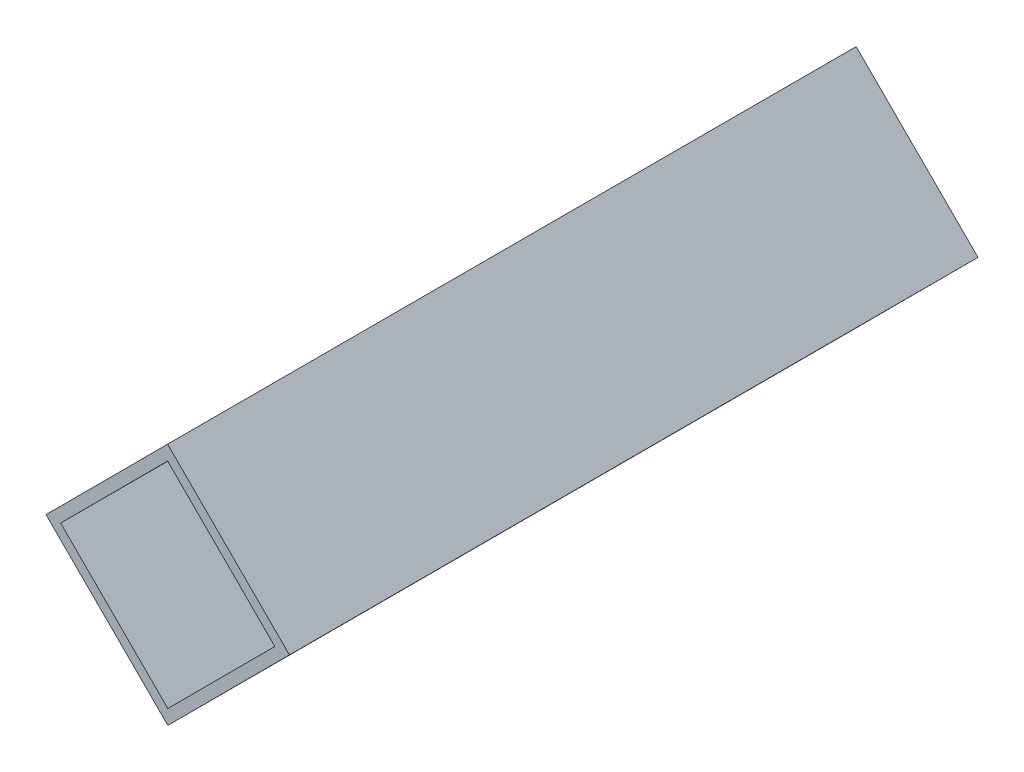
ISO-10303-21;
HEADER;
FILE_DESCRIPTION(('STEP AP214'),'2;1');
FILE_NAME('part.step','',(''),(''),'','','');
FILE_SCHEMA(('AUTOMOTIVE_DESIGN { 1 0 10303 214 1 1 1 1 }'));
ENDSEC;
DATA;
#1=APPLICATION_CONTEXT('core data for automotive mechanical design processes');
#2=APPLICATION_PROTOCOL_DEFINITION('international standard','automotive_design',2000,#1);
#3=PRODUCT_CONTEXT('',#1,'mechanical');
#4=PRODUCT('Part','Part','',(#3));
#5=PRODUCT_RELATED_PRODUCT_CATEGORY('part','',(#4));
#6=PRODUCT_DEFINITION_FORMATION('','',#4);
#7=PRODUCT_DEFINITION_CONTEXT('part definition',#1,'design');
#8=PRODUCT_DEFINITION('design','',#6,#7);
#9=PRODUCT_DEFINITION_SHAPE('','',#8);
#10=(LENGTH_UNIT() NAMED_UNIT(*) SI_UNIT(.MILLI.,.METRE.));
#11=(NAMED_UNIT(*) PLANE_ANGLE_UNIT() SI_UNIT($,.RADIAN.));
#12=(NAMED_UNIT(*) SI_UNIT($,.STERADIAN.) SOLID_ANGLE_UNIT());
#13=UNCERTAINTY_MEASURE_WITH_UNIT(LENGTH_MEASURE(1.E-05),#10,'distance_accuracy_value','');
#14=(GEOMETRIC_REPRESENTATION_CONTEXT(3) GLOBAL_UNCERTAINTY_ASSIGNED_CONTEXT((#13)) GLOBAL_UNIT_ASSIGNED_CONTEXT((#10,
#11,#12)) REPRESENTATION_CONTEXT('',''));
#15=CARTESIAN_POINT('',(0.,0.,0.));
#16=DIRECTION('',(0.,0.,1.));
#17=DIRECTION('',(1.,0.,0.));
#18=AXIS2_PLACEMENT_3D('',#15,#16,#17);
#19=CARTESIAN_POINT('',(0.,0.,100.));
#20=DIRECTION('',(0.,0.,1.));
#21=DIRECTION('',(1.,0.,0.));
#22=AXIS2_PLACEMENT_3D('',#19,#20,#21);
#23=PLANE('',#22);
#24=DIRECTION('',(-0.70646122875546,-0.707751744798503,0.));
#25=VECTOR('',#24,1.);
#26=CARTESIAN_POINT('',(0.,0.,100.));
#27=LINE('',#26,#25);
#28=CARTESIAN_POINT('',(0.,0.,100.));
#29=VERTEX_POINT('',#28);
#30=CARTESIAN_POINT('',(-17.6615307188865,-17.6937936199626,100.));
#31=VERTEX_POINT('',#30);
#32=EDGE_CURVE('E153',#29,#31,#27,.T.);
#33=ORIENTED_EDGE('',*,*,#32,.T.);
#34=DIRECTION('',(0.707751744798503,-0.70646122875546,0.));
#35=VECTOR('',#34,1.);
#36=CARTESIAN_POINT('',(-17.6615307188865,-17.6937936199626,100.));
#37=LINE('',#36,#35);
#38=CARTESIAN_POINT('',(0.0322629010760627,-35.3553243388491,100.));
#39=VERTEX_POINT('',#38);
#40=EDGE_CURVE('E157',#31,#39,#37,.T.);
#41=ORIENTED_EDGE('',*,*,#40,.T.);
#42=DIRECTION('',(0.70646122875546,0.707751744798503,0.));
#43=VECTOR('',#42,1.);
#44=CARTESIAN_POINT('',(17.6937936199626,-17.6615307188865,100.));
#45=LINE('',#44,#43);
#46=CARTESIAN_POINT('',(17.6937936199626,-17.6615307188865,100.));
#47=VERTEX_POINT('',#46);
#48=EDGE_CURVE('E161',#39,#47,#45,.T.);
#49=ORIENTED_EDGE('',*,*,#48,.T.);
#50=DIRECTION('',(-0.707751744798503,0.70646122875546,0.));
#51=VECTOR('',#50,1.);
#52=CARTESIAN_POINT('',(0.,0.,100.));
#53=LINE('',#52,#51);
#54=EDGE_CURVE('E164',#47,#29,#53,.T.);
#55=ORIENTED_EDGE('',*,*,#54,.T.);
#56=EDGE_LOOP('',(#33,#41,#49,#55));
#57=FACE_BOUND('',#56,.T.);
#58=DIRECTION('',(-0.706461228755461,-0.707751744798503,0.));
#59=VECTOR('',#58,1.);
#60=CARTESIAN_POINT('',(0.00193577406456353,-2.12131946033095,100.));
#61=LINE('',#60,#59);
#62=CARTESIAN_POINT('',(0.00193577406456353,-2.12131946033095,100.));
#63=VERTEX_POINT('',#62);
#64=CARTESIAN_POINT('',(-15.5402112585556,-17.691857845898,100.));
#65=VERTEX_POINT('',#64);
#66=EDGE_CURVE('E114',#63,#65,#61,.T.);
#67=ORIENTED_EDGE('',*,*,#66,.F.);
#68=DIRECTION('',(-0.707751744798503,0.70646122875546,0.));
#69=VECTOR('',#68,1.);
#70=CARTESIAN_POINT('',(0.00193577406456353,-2.12131946033095,100.));
#71=LINE('',#70,#69);
#72=CARTESIAN_POINT('',(15.5724741596316,-17.6634664929511,100.));
#73=VERTEX_POINT('',#72);
#74=EDGE_CURVE('E105',#73,#63,#71,.T.);
#75=ORIENTED_EDGE('',*,*,#74,.F.);
#76=DIRECTION('',(0.70646122875546,0.707751744798503,0.));
#77=VECTOR('',#76,1.);
#78=CARTESIAN_POINT('',(15.5724741596316,-17.6634664929511,100.));
#79=LINE('',#78,#77);
#80=CARTESIAN_POINT('',(0.0303271270114952,-33.2340048785181,100.));
#81=VERTEX_POINT('',#80);
#82=EDGE_CURVE('E131',#81,#73,#79,.T.);
#83=ORIENTED_EDGE('',*,*,#82,.F.);
#84=DIRECTION('',(0.707751744798503,-0.70646122875546,0.));
#85=VECTOR('',#84,1.);
#86=CARTESIAN_POINT('',(-15.5402112585556,-17.691857845898,100.));
#87=LINE('',#86,#85);
#88=EDGE_CURVE('E127',#65,#81,#87,.T.);
#89=ORIENTED_EDGE('',*,*,#88,.F.);
#90=EDGE_LOOP('',(#67,#75,#83,#89));
#91=FACE_BOUND('',#90,.T.);
#92=ADVANCED_FACE('F39',(#57,#91),#23,.T.);
#93=CARTESIAN_POINT('',(0.,0.,0.));
#94=DIRECTION('',(0.,0.,1.));
#95=DIRECTION('',(1.,0.,0.));
#96=AXIS2_PLACEMENT_3D('',#93,#94,#95);
#97=PLANE('',#96);
#98=DIRECTION('',(-0.70646122875546,-0.707751744798503,0.));
#99=VECTOR('',#98,1.);
#100=CARTESIAN_POINT('',(0.,0.,0.));
#101=LINE('',#100,#99);
#102=CARTESIAN_POINT('',(0.,0.,0.));
#103=VERTEX_POINT('',#102);
#104=CARTESIAN_POINT('',(-17.6615307188865,-17.6937936199626,0.));
#105=VERTEX_POINT('',#104);
#106=EDGE_CURVE('E123',#103,#105,#101,.T.);
#107=ORIENTED_EDGE('',*,*,#106,.F.);
#108=DIRECTION('',(-0.707751744798503,0.70646122875546,0.));
#109=VECTOR('',#108,1.);
#110=CARTESIAN_POINT('',(0.,0.,0.));
#111=LINE('',#110,#109);
#112=CARTESIAN_POINT('',(17.6937936199626,-17.6615307188865,0.));
#113=VERTEX_POINT('',#112);
#114=EDGE_CURVE('E158',#113,#103,#111,.T.);
#115=ORIENTED_EDGE('',*,*,#114,.F.);
#116=DIRECTION('',(0.70646122875546,0.707751744798503,0.));
#117=VECTOR('',#116,1.);
#118=CARTESIAN_POINT('',(17.6937936199626,-17.6615307188865,0.));
#119=LINE('',#118,#117);
#120=CARTESIAN_POINT('',(0.0322629010760627,-35.3553243388491,0.));
#121=VERTEX_POINT('',#120);
#122=EDGE_CURVE('E174',#121,#113,#119,.T.);
#123=ORIENTED_EDGE('',*,*,#122,.F.);
#124=DIRECTION('',(0.707751744798503,-0.70646122875546,0.));
#125=VECTOR('',#124,1.);
#126=CARTESIAN_POINT('',(-17.6615307188865,-17.6937936199626,0.));
#127=LINE('',#126,#125);
#128=EDGE_CURVE('E171',#105,#121,#127,.T.);
#129=ORIENTED_EDGE('',*,*,#128,.F.);
#130=EDGE_LOOP('',(#107,#115,#123,#129));
#131=FACE_BOUND('',#130,.T.);
#132=DIRECTION('',(-0.707751744798503,0.70646122875546,0.));
#133=VECTOR('',#132,1.);
#134=CARTESIAN_POINT('',(0.00193577406456353,-2.12131946033095,0.));
#135=LINE('',#134,#133);
#136=CARTESIAN_POINT('',(15.5724741596316,-17.6634664929511,0.));
#137=VERTEX_POINT('',#136);
#138=CARTESIAN_POINT('',(0.00193577406456353,-2.12131946033095,0.));
#139=VERTEX_POINT('',#138);
#140=EDGE_CURVE('E63',#137,#139,#135,.T.);
#141=ORIENTED_EDGE('',*,*,#140,.T.);
#142=DIRECTION('',(-0.706461228755461,-0.707751744798503,0.));
#143=VECTOR('',#142,1.);
#144=CARTESIAN_POINT('',(0.00193577406456353,-2.12131946033095,0.));
#145=LINE('',#144,#143);
#146=CARTESIAN_POINT('',(-15.5402112585556,-17.691857845898,0.));
#147=VERTEX_POINT('',#146);
#148=EDGE_CURVE('E121',#139,#147,#145,.T.);
#149=ORIENTED_EDGE('',*,*,#148,.T.);
#150=DIRECTION('',(0.707751744798503,-0.70646122875546,0.));
#151=VECTOR('',#150,1.);
#152=CARTESIAN_POINT('',(-15.5402112585556,-17.691857845898,0.));
#153=LINE('',#152,#151);
#154=CARTESIAN_POINT('',(0.0303271270114987,-33.2340048785181,0.));
#155=VERTEX_POINT('',#154);
#156=EDGE_CURVE('E140',#147,#155,#153,.T.);
#157=ORIENTED_EDGE('',*,*,#156,.T.);
#158=DIRECTION('',(0.70646122875546,0.707751744798503,0.));
#159=VECTOR('',#158,1.);
#160=CARTESIAN_POINT('',(15.5724741596316,-17.6634664929511,0.));
#161=LINE('',#160,#159);
#162=EDGE_CURVE('E115',#155,#137,#161,.T.);
#163=ORIENTED_EDGE('',*,*,#162,.T.);
#164=EDGE_LOOP('',(#141,#149,#157,#163));
#165=FACE_BOUND('',#164,.T.);
#166=ADVANCED_FACE('F197',(#131,#165),#97,.F.);
#167=CARTESIAN_POINT('',(0.,0.,100.));
#168=DIRECTION('',(0.707751744798503,-0.70646122875546,0.));
#169=DIRECTION('',(0.70646122875546,0.707751744798503,0.));
#170=AXIS2_PLACEMENT_3D('',#167,#168,#169);
#171=PLANE('',#170);
#172=ORIENTED_EDGE('',*,*,#106,.T.);
#173=DIRECTION('',(0.,0.,-1.));
#174=VECTOR('',#173,1.);
#175=CARTESIAN_POINT('',(-17.6615307188865,-17.6937936199626,100.));
#176=LINE('',#175,#174);
#177=EDGE_CURVE('E11',#31,#105,#176,.T.);
#178=ORIENTED_EDGE('',*,*,#177,.F.);
#179=ORIENTED_EDGE('',*,*,#32,.F.);
#180=DIRECTION('',(0.,0.,-1.));
#181=VECTOR('',#180,1.);
#182=CARTESIAN_POINT('',(0.,0.,100.));
#183=LINE('',#182,#181);
#184=EDGE_CURVE('E167',#29,#103,#183,.T.);
#185=ORIENTED_EDGE('',*,*,#184,.T.);
#186=EDGE_LOOP('',(#172,#178,#179,#185));
#187=FACE_BOUND('',#186,.T.);
#188=ADVANCED_FACE('F41',(#187),#171,.F.);
#189=CARTESIAN_POINT('',(-17.6615307188865,-17.6937936199626,100.));
#190=DIRECTION('',(0.70646122875546,0.707751744798503,0.));
#191=DIRECTION('',(-0.707751744798503,0.70646122875546,0.));
#192=AXIS2_PLACEMENT_3D('',#189,#190,#191);
#193=PLANE('',#192);
#194=ORIENTED_EDGE('',*,*,#128,.T.);
#195=DIRECTION('',(0.,0.,-1.));
#196=VECTOR('',#195,1.);
#197=CARTESIAN_POINT('',(0.0322629010760627,-35.3553243388491,100.));
#198=LINE('',#197,#196);
#199=EDGE_CURVE('E48',#39,#121,#198,.T.);
#200=ORIENTED_EDGE('',*,*,#199,.F.);
#201=ORIENTED_EDGE('',*,*,#40,.F.);
#202=ORIENTED_EDGE('',*,*,#177,.T.);
#203=EDGE_LOOP('',(#194,#200,#201,#202));
#204=FACE_BOUND('',#203,.T.);
#205=ADVANCED_FACE('F207',(#204),#193,.F.);
#206=CARTESIAN_POINT('',(17.6937936199626,-17.6615307188865,100.));
#207=DIRECTION('',(-0.707751744798503,0.70646122875546,0.));
#208=DIRECTION('',(-0.70646122875546,-0.707751744798503,0.));
#209=AXIS2_PLACEMENT_3D('',#206,#207,#208);
#210=PLANE('',#209);
#211=ORIENTED_EDGE('',*,*,#122,.T.);
#212=DIRECTION('',(0.,0.,-1.));
#213=VECTOR('',#212,1.);
#214=CARTESIAN_POINT('',(17.6937936199626,-17.6615307188865,100.));
#215=LINE('',#214,#213);
#216=EDGE_CURVE('E182',#47,#113,#215,.T.);
#217=ORIENTED_EDGE('',*,*,#216,.F.);
#218=ORIENTED_EDGE('',*,*,#48,.F.);
#219=ORIENTED_EDGE('',*,*,#199,.T.);
#220=EDGE_LOOP('',(#211,#217,#218,#219));
#221=FACE_BOUND('',#220,.T.);
#222=ADVANCED_FACE('F191',(#221),#210,.F.);
#223=CARTESIAN_POINT('',(0.,0.,100.));
#224=DIRECTION('',(-0.70646122875546,-0.707751744798503,0.));
#225=DIRECTION('',(0.707751744798503,-0.70646122875546,0.));
#226=AXIS2_PLACEMENT_3D('',#223,#224,#225);
#227=PLANE('',#226);
#228=ORIENTED_EDGE('',*,*,#114,.T.);
#229=ORIENTED_EDGE('',*,*,#184,.F.);
#230=ORIENTED_EDGE('',*,*,#54,.F.);
#231=ORIENTED_EDGE('',*,*,#216,.T.);
#232=EDGE_LOOP('',(#228,#229,#230,#231));
#233=FACE_BOUND('',#232,.T.);
#234=ADVANCED_FACE('F201',(#233),#227,.F.);
#235=CARTESIAN_POINT('',(0.00193577406456353,-2.12131946033095,100.));
#236=DIRECTION('',(-0.70646122875546,-0.707751744798503,0.));
#237=DIRECTION('',(0.707751744798503,-0.70646122875546,0.));
#238=AXIS2_PLACEMENT_3D('',#235,#236,#237);
#239=PLANE('',#238);
#240=ORIENTED_EDGE('',*,*,#140,.F.);
#241=DIRECTION('',(0.,0.,-1.));
#242=VECTOR('',#241,1.);
#243=CARTESIAN_POINT('',(15.5724741596316,-17.6634664929511,100.));
#244=LINE('',#243,#242);
#245=EDGE_CURVE('E109',#73,#137,#244,.T.);
#246=ORIENTED_EDGE('',*,*,#245,.F.);
#247=ORIENTED_EDGE('',*,*,#74,.T.);
#248=DIRECTION('',(0.,0.,-1.));
#249=VECTOR('',#248,1.);
#250=CARTESIAN_POINT('',(0.00193577406456353,-2.12131946033095,100.));
#251=LINE('',#250,#249);
#252=EDGE_CURVE('E108',#63,#139,#251,.T.);
#253=ORIENTED_EDGE('',*,*,#252,.T.);
#254=EDGE_LOOP('',(#240,#246,#247,#253));
#255=FACE_BOUND('',#254,.T.);
#256=ADVANCED_FACE('F107',(#255),#239,.T.);
#257=CARTESIAN_POINT('',(0.00193577406456353,-2.12131946033095,100.));
#258=DIRECTION('',(0.707751744798503,-0.70646122875546,0.));
#259=DIRECTION('',(0.706461228755461,0.707751744798503,0.));
#260=AXIS2_PLACEMENT_3D('',#257,#258,#259);
#261=PLANE('',#260);
#262=ORIENTED_EDGE('',*,*,#148,.F.);
#263=ORIENTED_EDGE('',*,*,#252,.F.);
#264=ORIENTED_EDGE('',*,*,#66,.T.);
#265=DIRECTION('',(0.,0.,-1.));
#266=VECTOR('',#265,1.);
#267=CARTESIAN_POINT('',(-15.5402112585556,-17.691857845898,100.));
#268=LINE('',#267,#266);
#269=EDGE_CURVE('E124',#65,#147,#268,.T.);
#270=ORIENTED_EDGE('',*,*,#269,.T.);
#271=EDGE_LOOP('',(#262,#263,#264,#270));
#272=FACE_BOUND('',#271,.T.);
#273=ADVANCED_FACE('F118',(#272),#261,.T.);
#274=CARTESIAN_POINT('',(-15.5402112585556,-17.691857845898,100.));
#275=DIRECTION('',(0.70646122875546,0.707751744798503,0.));
#276=DIRECTION('',(-0.707751744798503,0.70646122875546,0.));
#277=AXIS2_PLACEMENT_3D('',#274,#275,#276);
#278=PLANE('',#277);
#279=ORIENTED_EDGE('',*,*,#156,.F.);
#280=ORIENTED_EDGE('',*,*,#269,.F.);
#281=ORIENTED_EDGE('',*,*,#88,.T.);
#282=DIRECTION('',(0.,0.,-1.));
#283=VECTOR('',#282,1.);
#284=CARTESIAN_POINT('',(0.0303271270114987,-33.2340048785181,100.));
#285=LINE('',#284,#283);
#286=EDGE_CURVE('E55',#81,#155,#285,.T.);
#287=ORIENTED_EDGE('',*,*,#286,.T.);
#288=EDGE_LOOP('',(#279,#280,#281,#287));
#289=FACE_BOUND('',#288,.T.);
#290=ADVANCED_FACE('F230',(#289),#278,.T.);
#291=CARTESIAN_POINT('',(15.5724741596316,-17.6634664929511,100.));
#292=DIRECTION('',(-0.707751744798503,0.70646122875546,0.));
#293=DIRECTION('',(-0.70646122875546,-0.707751744798503,0.));
#294=AXIS2_PLACEMENT_3D('',#291,#292,#293);
#295=PLANE('',#294);
#296=ORIENTED_EDGE('',*,*,#162,.F.);
#297=ORIENTED_EDGE('',*,*,#286,.F.);
#298=ORIENTED_EDGE('',*,*,#82,.T.);
#299=ORIENTED_EDGE('',*,*,#245,.T.);
#300=EDGE_LOOP('',(#296,#297,#298,#299));
#301=FACE_BOUND('',#300,.T.);
#302=ADVANCED_FACE('F234',(#301),#295,.T.);
#303=CLOSED_SHELL('',(#92,#166,#188,#205,#222,#234,#256,#273,#290,#302));
#304=MANIFOLD_SOLID_BREP('B2',#303);
#305=ADVANCED_BREP_SHAPE_REPRESENTATION('',(#18,#304),#14);
#306=SHAPE_DEFINITION_REPRESENTATION(#9,#305);
ENDSEC;
END-ISO-10303-21;
